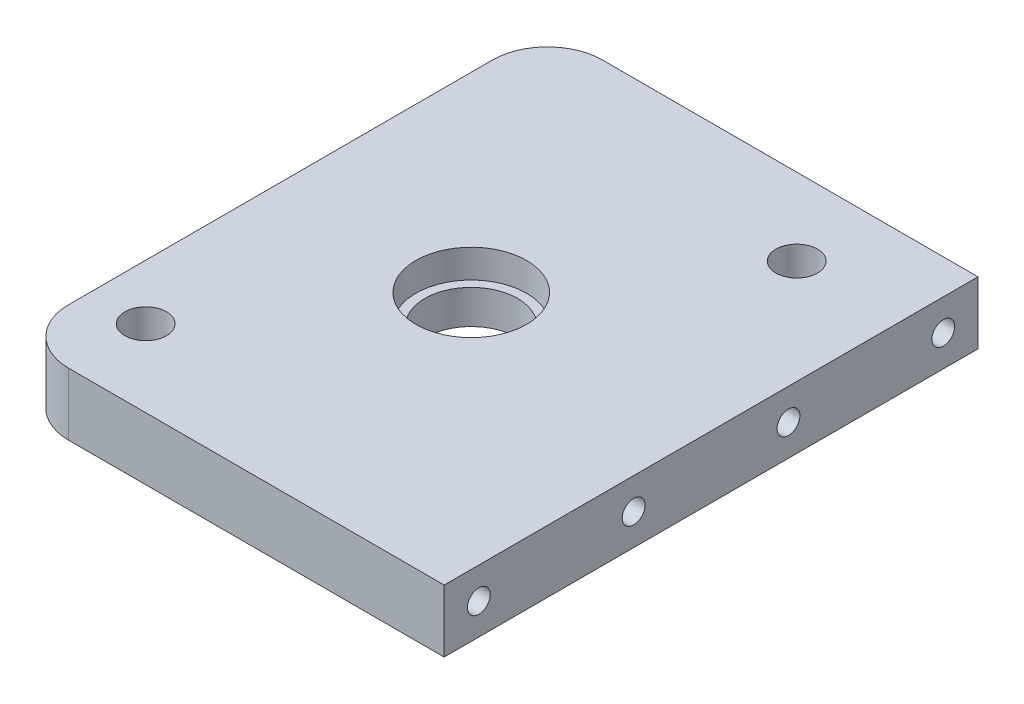
ISO-10303-21;
HEADER;
FILE_DESCRIPTION(('STEP AP214'),'2;1');
FILE_NAME('part.step','',(''),(''),'','','');
FILE_SCHEMA(('AUTOMOTIVE_DESIGN { 1 0 10303 214 1 1 1 1 }'));
ENDSEC;
DATA;
#1=APPLICATION_CONTEXT('core data for automotive mechanical design processes');
#2=APPLICATION_PROTOCOL_DEFINITION('international standard','automotive_design',2000,#1);
#3=PRODUCT_CONTEXT('',#1,'mechanical');
#4=PRODUCT('Part','Part','',(#3));
#5=PRODUCT_RELATED_PRODUCT_CATEGORY('part','',(#4));
#6=PRODUCT_DEFINITION_FORMATION('','',#4);
#7=PRODUCT_DEFINITION_CONTEXT('part definition',#1,'design');
#8=PRODUCT_DEFINITION('design','',#6,#7);
#9=PRODUCT_DEFINITION_SHAPE('','',#8);
#10=(LENGTH_UNIT() NAMED_UNIT(*) SI_UNIT(.MILLI.,.METRE.));
#11=(NAMED_UNIT(*) PLANE_ANGLE_UNIT() SI_UNIT($,.RADIAN.));
#12=(NAMED_UNIT(*) SI_UNIT($,.STERADIAN.) SOLID_ANGLE_UNIT());
#13=UNCERTAINTY_MEASURE_WITH_UNIT(LENGTH_MEASURE(1.E-05),#10,'distance_accuracy_value','');
#14=(GEOMETRIC_REPRESENTATION_CONTEXT(3) GLOBAL_UNCERTAINTY_ASSIGNED_CONTEXT((#13)) GLOBAL_UNIT_ASSIGNED_CONTEXT((#10,
#11,#12)) REPRESENTATION_CONTEXT('',''));
#15=CARTESIAN_POINT('',(0.,0.,0.));
#16=DIRECTION('',(0.,0.,1.));
#17=DIRECTION('',(1.,0.,0.));
#18=AXIS2_PLACEMENT_3D('',#15,#16,#17);
#19=CARTESIAN_POINT('',(18.6,-83.075,0.));
#20=DIRECTION('',(1.,0.,0.));
#21=DIRECTION('',(0.,0.,1.));
#22=AXIS2_PLACEMENT_3D('',#19,#20,#21);
#23=PLANE('',#22);
#24=CARTESIAN_POINT('',(18.6,-214.5,33.5));
#25=DIRECTION('',(1.,0.,0.));
#26=DIRECTION('',(0.,0.,-1.));
#27=AXIS2_PLACEMENT_3D('',#24,#25,#26);
#28=CIRCLE('',#27,1.65);
#29=CARTESIAN_POINT('',(18.6,-214.5,31.85));
#30=VERTEX_POINT('',#29);
#31=EDGE_CURVE('E11',#30,#30,#28,.T.);
#32=ORIENTED_EDGE('',*,*,#31,.T.);
#33=EDGE_LOOP('',(#32));
#34=FACE_BOUND('',#33,.T.);
#35=ADVANCED_FACE('F16',(#34),#23,.T.);
#36=CARTESIAN_POINT('',(18.6,-214.5,33.5));
#37=DIRECTION('',(1.,0.,0.));
#38=DIRECTION('',(0.,0.,-1.));
#39=AXIS2_PLACEMENT_3D('',#36,#37,#38);
#40=CYLINDRICAL_SURFACE('',#39,1.65);
#41=CARTESIAN_POINT('',(34.6,-214.5,33.5));
#42=DIRECTION('',(1.,0.,0.));
#43=DIRECTION('',(0.,0.,-1.));
#44=AXIS2_PLACEMENT_3D('',#41,#42,#43);
#45=CIRCLE('',#44,1.65);
#46=CARTESIAN_POINT('',(34.6,-214.5,31.85));
#47=VERTEX_POINT('',#46);
#48=EDGE_CURVE('E170',#47,#47,#45,.T.);
#49=ORIENTED_EDGE('',*,*,#48,.T.);
#50=EDGE_LOOP('',(#49));
#51=FACE_BOUND('',#50,.T.);
#52=ORIENTED_EDGE('',*,*,#31,.F.);
#53=EDGE_LOOP('',(#52));
#54=FACE_BOUND('',#53,.T.);
#55=ADVANCED_FACE('F266',(#51,#54),#40,.F.);
#56=CARTESIAN_POINT('',(18.6,-83.075,0.));
#57=DIRECTION('',(1.,0.,0.));
#58=DIRECTION('',(0.,0.,1.));
#59=AXIS2_PLACEMENT_3D('',#56,#57,#58);
#60=PLANE('',#59);
#61=CARTESIAN_POINT('',(18.6,-214.5,11.1666666666666));
#62=DIRECTION('',(1.,0.,0.));
#63=DIRECTION('',(0.,0.,-1.));
#64=AXIS2_PLACEMENT_3D('',#61,#62,#63);
#65=CIRCLE('',#64,1.65);
#66=CARTESIAN_POINT('',(18.6,-214.5,9.51666666666664));
#67=VERTEX_POINT('',#66);
#68=EDGE_CURVE('E27',#67,#67,#65,.T.);
#69=ORIENTED_EDGE('',*,*,#68,.T.);
#70=EDGE_LOOP('',(#69));
#71=FACE_BOUND('',#70,.T.);
#72=ADVANCED_FACE('F18',(#71),#60,.T.);
#73=CARTESIAN_POINT('',(18.6,-214.5,11.1666666666666));
#74=DIRECTION('',(1.,0.,0.));
#75=DIRECTION('',(0.,0.,-1.));
#76=AXIS2_PLACEMENT_3D('',#73,#74,#75);
#77=CYLINDRICAL_SURFACE('',#76,1.65);
#78=CARTESIAN_POINT('',(34.6,-214.5,11.1666666666666));
#79=DIRECTION('',(1.,0.,0.));
#80=DIRECTION('',(0.,0.,-1.));
#81=AXIS2_PLACEMENT_3D('',#78,#79,#80);
#82=CIRCLE('',#81,1.65);
#83=CARTESIAN_POINT('',(34.6,-214.5,9.51666666666664));
#84=VERTEX_POINT('',#83);
#85=EDGE_CURVE('E174',#84,#84,#82,.T.);
#86=ORIENTED_EDGE('',*,*,#85,.T.);
#87=EDGE_LOOP('',(#86));
#88=FACE_BOUND('',#87,.T.);
#89=ORIENTED_EDGE('',*,*,#68,.F.);
#90=EDGE_LOOP('',(#89));
#91=FACE_BOUND('',#90,.T.);
#92=ADVANCED_FACE('F338',(#88,#91),#77,.F.);
#93=CARTESIAN_POINT('',(18.6,-83.075,0.));
#94=DIRECTION('',(1.,0.,0.));
#95=DIRECTION('',(0.,0.,1.));
#96=AXIS2_PLACEMENT_3D('',#93,#94,#95);
#97=PLANE('',#96);
#98=CARTESIAN_POINT('',(18.6,-214.5,-11.1666666666666));
#99=DIRECTION('',(-1.,0.,0.));
#100=DIRECTION('',(0.,0.,-1.));
#101=AXIS2_PLACEMENT_3D('',#98,#99,#100);
#102=CIRCLE('',#101,1.65);
#103=CARTESIAN_POINT('',(18.6,-214.5,-12.8166666666666));
#104=VERTEX_POINT('',#103);
#105=EDGE_CURVE('E168',#104,#104,#102,.T.);
#106=ORIENTED_EDGE('',*,*,#105,.F.);
#107=EDGE_LOOP('',(#106));
#108=FACE_BOUND('',#107,.T.);
#109=ADVANCED_FACE('F274',(#108),#97,.T.);
#110=CARTESIAN_POINT('',(18.6,-214.5,-11.1666666666666));
#111=DIRECTION('',(1.,0.,0.));
#112=DIRECTION('',(0.,0.,-1.));
#113=AXIS2_PLACEMENT_3D('',#110,#111,#112);
#114=CYLINDRICAL_SURFACE('',#113,1.65);
#115=CARTESIAN_POINT('',(34.6,-214.5,-11.1666666666666));
#116=DIRECTION('',(-1.,0.,0.));
#117=DIRECTION('',(0.,0.,-1.));
#118=AXIS2_PLACEMENT_3D('',#115,#116,#117);
#119=CIRCLE('',#118,1.65);
#120=CARTESIAN_POINT('',(34.6,-214.5,-12.8166666666666));
#121=VERTEX_POINT('',#120);
#122=EDGE_CURVE('E182',#121,#121,#119,.T.);
#123=ORIENTED_EDGE('',*,*,#122,.F.);
#124=EDGE_LOOP('',(#123));
#125=FACE_BOUND('',#124,.T.);
#126=ORIENTED_EDGE('',*,*,#105,.T.);
#127=EDGE_LOOP('',(#126));
#128=FACE_BOUND('',#127,.T.);
#129=ADVANCED_FACE('F344',(#125,#128),#114,.F.);
#130=CARTESIAN_POINT('',(18.6,-83.075,0.));
#131=DIRECTION('',(1.,0.,0.));
#132=DIRECTION('',(0.,0.,1.));
#133=AXIS2_PLACEMENT_3D('',#130,#131,#132);
#134=PLANE('',#133);
#135=CARTESIAN_POINT('',(18.6,-214.5,-33.5));
#136=DIRECTION('',(-1.,0.,0.));
#137=DIRECTION('',(0.,0.,-1.));
#138=AXIS2_PLACEMENT_3D('',#135,#136,#137);
#139=CIRCLE('',#138,1.65);
#140=CARTESIAN_POINT('',(18.6,-214.5,-35.15));
#141=VERTEX_POINT('',#140);
#142=EDGE_CURVE('E165',#141,#141,#139,.T.);
#143=ORIENTED_EDGE('',*,*,#142,.F.);
#144=EDGE_LOOP('',(#143));
#145=FACE_BOUND('',#144,.T.);
#146=ADVANCED_FACE('F260',(#145),#134,.T.);
#147=CARTESIAN_POINT('',(18.6,-214.5,-33.5));
#148=DIRECTION('',(1.,0.,0.));
#149=DIRECTION('',(0.,0.,-1.));
#150=AXIS2_PLACEMENT_3D('',#147,#148,#149);
#151=CYLINDRICAL_SURFACE('',#150,1.65);
#152=CARTESIAN_POINT('',(34.6,-214.5,-33.5));
#153=DIRECTION('',(-1.,0.,0.));
#154=DIRECTION('',(0.,0.,-1.));
#155=AXIS2_PLACEMENT_3D('',#152,#153,#154);
#156=CIRCLE('',#155,1.65);
#157=CARTESIAN_POINT('',(34.6,-214.5,-35.15));
#158=VERTEX_POINT('',#157);
#159=EDGE_CURVE('E179',#158,#158,#156,.T.);
#160=ORIENTED_EDGE('',*,*,#159,.F.);
#161=EDGE_LOOP('',(#160));
#162=FACE_BOUND('',#161,.T.);
#163=ORIENTED_EDGE('',*,*,#142,.T.);
#164=EDGE_LOOP('',(#163));
#165=FACE_BOUND('',#164,.T.);
#166=ADVANCED_FACE('F255',(#162,#165),#151,.F.);
#167=CARTESIAN_POINT('',(7.05,-214.5,0.));
#168=DIRECTION('',(0.,-1.,0.));
#169=DIRECTION('',(0.,0.,-1.));
#170=AXIS2_PLACEMENT_3D('',#167,#168,#169);
#171=PLANE('',#170);
#172=CARTESIAN_POINT('',(-19.562381937191,-214.5,27.3873347120674));
#173=DIRECTION('',(0.,-1.,0.));
#174=DIRECTION('',(0.,0.,-1.));
#175=AXIS2_PLACEMENT_3D('',#172,#173,#174);
#176=CIRCLE('',#175,3.);
#177=CARTESIAN_POINT('',(-19.562381937191,-214.5,24.3873347120674));
#178=VERTEX_POINT('',#177);
#179=EDGE_CURVE('E169',#178,#178,#176,.T.);
#180=ORIENTED_EDGE('',*,*,#179,.F.);
#181=EDGE_LOOP('',(#180));
#182=FACE_BOUND('',#181,.T.);
#183=ADVANCED_FACE('F250',(#182),#171,.F.);
#184=CARTESIAN_POINT('',(-19.562381937191,-214.5,27.3873347120674));
#185=DIRECTION('',(0.,1.,0.));
#186=DIRECTION('',(0.,0.,1.));
#187=AXIS2_PLACEMENT_3D('',#184,#185,#186);
#188=CYLINDRICAL_SURFACE('',#187,3.);
#189=CARTESIAN_POINT('',(-19.562381937191,-210.,27.3873347120674));
#190=DIRECTION('',(0.,-1.,0.));
#191=DIRECTION('',(0.,0.,-1.));
#192=AXIS2_PLACEMENT_3D('',#189,#190,#191);
#193=CIRCLE('',#192,3.);
#194=CARTESIAN_POINT('',(-19.562381937191,-210.,24.3873347120674));
#195=VERTEX_POINT('',#194);
#196=EDGE_CURVE('E154',#195,#195,#193,.T.);
#197=ORIENTED_EDGE('',*,*,#196,.F.);
#198=EDGE_LOOP('',(#197));
#199=FACE_BOUND('',#198,.T.);
#200=ORIENTED_EDGE('',*,*,#179,.T.);
#201=EDGE_LOOP('',(#200));
#202=FACE_BOUND('',#201,.T.);
#203=ADVANCED_FACE('F246',(#199,#202),#188,.F.);
#204=CARTESIAN_POINT('',(7.05,-214.5,0.));
#205=DIRECTION('',(0.,-1.,0.));
#206=DIRECTION('',(0.,0.,-1.));
#207=AXIS2_PLACEMENT_3D('',#204,#205,#206);
#208=PLANE('',#207);
#209=CARTESIAN_POINT('',(19.562381937191,-214.5,-27.3873347120674));
#210=DIRECTION('',(0.,-1.,0.));
#211=DIRECTION('',(0.,0.,-1.));
#212=AXIS2_PLACEMENT_3D('',#209,#210,#211);
#213=CIRCLE('',#212,3.);
#214=CARTESIAN_POINT('',(19.562381937191,-214.5,-30.3873347120674));
#215=VERTEX_POINT('',#214);
#216=EDGE_CURVE('E151',#215,#215,#213,.T.);
#217=ORIENTED_EDGE('',*,*,#216,.F.);
#218=EDGE_LOOP('',(#217));
#219=FACE_BOUND('',#218,.T.);
#220=ADVANCED_FACE('F249',(#219),#208,.F.);
#221=CARTESIAN_POINT('',(19.562381937191,-214.5,-27.3873347120674));
#222=DIRECTION('',(0.,1.,0.));
#223=DIRECTION('',(0.,0.,1.));
#224=AXIS2_PLACEMENT_3D('',#221,#222,#223);
#225=CYLINDRICAL_SURFACE('',#224,3.);
#226=CARTESIAN_POINT('',(19.562381937191,-210.,-27.3873347120674));
#227=DIRECTION('',(0.,-1.,0.));
#228=DIRECTION('',(0.,0.,-1.));
#229=AXIS2_PLACEMENT_3D('',#226,#227,#228);
#230=CIRCLE('',#229,3.);
#231=CARTESIAN_POINT('',(19.562381937191,-210.,-30.3873347120674));
#232=VERTEX_POINT('',#231);
#233=EDGE_CURVE('E144',#232,#232,#230,.T.);
#234=ORIENTED_EDGE('',*,*,#233,.F.);
#235=EDGE_LOOP('',(#234));
#236=FACE_BOUND('',#235,.T.);
#237=ORIENTED_EDGE('',*,*,#216,.T.);
#238=EDGE_LOOP('',(#237));
#239=FACE_BOUND('',#238,.T.);
#240=ADVANCED_FACE('F364',(#236,#239),#225,.F.);
#241=CARTESIAN_POINT('',(7.05,-214.1,0.));
#242=DIRECTION('',(0.,-1.,0.));
#243=DIRECTION('',(0.,0.,-1.));
#244=AXIS2_PLACEMENT_3D('',#241,#242,#243);
#245=PLANE('',#244);
#246=CARTESIAN_POINT('',(0.,-214.1,0.));
#247=DIRECTION('',(0.,-1.,0.));
#248=DIRECTION('',(0.,0.,-1.));
#249=AXIS2_PLACEMENT_3D('',#246,#247,#248);
#250=CIRCLE('',#249,7.99);
#251=CARTESIAN_POINT('',(0.,-214.1,-7.99));
#252=VERTEX_POINT('',#251);
#253=EDGE_CURVE('E143',#252,#252,#250,.T.);
#254=ORIENTED_EDGE('',*,*,#253,.F.);
#255=EDGE_LOOP('',(#254));
#256=FACE_BOUND('',#255,.T.);
#257=CARTESIAN_POINT('',(0.,-214.1,0.));
#258=DIRECTION('',(0.,-1.,0.));
#259=DIRECTION('',(0.,0.,-1.));
#260=AXIS2_PLACEMENT_3D('',#257,#258,#259);
#261=CIRCLE('',#260,6.696);
#262=CARTESIAN_POINT('',(0.,-214.1,-6.696));
#263=VERTEX_POINT('',#262);
#264=EDGE_CURVE('E177',#263,#263,#261,.T.);
#265=ORIENTED_EDGE('',*,*,#264,.T.);
#266=EDGE_LOOP('',(#265));
#267=FACE_BOUND('',#266,.T.);
#268=ADVANCED_FACE('F278',(#256,#267),#245,.F.);
#269=CARTESIAN_POINT('',(0.,-214.1,0.));
#270=DIRECTION('',(0.,1.,0.));
#271=DIRECTION('',(0.,0.,1.));
#272=AXIS2_PLACEMENT_3D('',#269,#270,#271);
#273=CYLINDRICAL_SURFACE('',#272,7.99);
#274=CARTESIAN_POINT('',(0.,-210.,0.));
#275=DIRECTION('',(0.,-1.,0.));
#276=DIRECTION('',(0.,0.,-1.));
#277=AXIS2_PLACEMENT_3D('',#274,#275,#276);
#278=CIRCLE('',#277,7.99);
#279=CARTESIAN_POINT('',(0.,-210.,-7.99));
#280=VERTEX_POINT('',#279);
#281=EDGE_CURVE('E138',#280,#280,#278,.T.);
#282=ORIENTED_EDGE('',*,*,#281,.F.);
#283=EDGE_LOOP('',(#282));
#284=FACE_BOUND('',#283,.T.);
#285=ORIENTED_EDGE('',*,*,#253,.T.);
#286=EDGE_LOOP('',(#285));
#287=FACE_BOUND('',#286,.T.);
#288=ADVANCED_FACE('F275',(#284,#287),#273,.F.);
#289=CARTESIAN_POINT('',(7.05,-210.,0.));
#290=DIRECTION('',(0.,-1.,0.));
#291=DIRECTION('',(0.,0.,-1.));
#292=AXIS2_PLACEMENT_3D('',#289,#290,#291);
#293=PLANE('',#292);
#294=CARTESIAN_POINT('',(-19.562381937191,-210.,-30.5623819371909));
#295=DIRECTION('',(0.,-1.,0.));
#296=DIRECTION('',(0.,0.,-1.));
#297=AXIS2_PLACEMENT_3D('',#294,#295,#296);
#298=CIRCLE('',#297,7.93761806280911);
#299=CARTESIAN_POINT('',(-27.5,-210.,-30.5623819371909));
#300=VERTEX_POINT('',#299);
#301=CARTESIAN_POINT('',(-19.562381937191,-210.,-38.5));
#302=VERTEX_POINT('',#301);
#303=EDGE_CURVE('E173',#300,#302,#298,.T.);
#304=ORIENTED_EDGE('',*,*,#303,.F.);
#305=DIRECTION('',(0.,0.,-1.));
#306=VECTOR('',#305,1.);
#307=CARTESIAN_POINT('',(-27.5,-210.,0.));
#308=LINE('',#307,#306);
#309=CARTESIAN_POINT('',(-27.5,-210.,30.562381937191));
#310=VERTEX_POINT('',#309);
#311=EDGE_CURVE('E204',#310,#300,#308,.T.);
#312=ORIENTED_EDGE('',*,*,#311,.F.);
#313=CARTESIAN_POINT('',(-19.562381937191,-210.,30.562381937191));
#314=DIRECTION('',(0.,-1.,0.));
#315=DIRECTION('',(0.,0.,-1.));
#316=AXIS2_PLACEMENT_3D('',#313,#314,#315);
#317=CIRCLE('',#316,7.93761806280904);
#318=CARTESIAN_POINT('',(-19.562381937191,-210.,38.5));
#319=VERTEX_POINT('',#318);
#320=EDGE_CURVE('E20',#319,#310,#317,.T.);
#321=ORIENTED_EDGE('',*,*,#320,.F.);
#322=DIRECTION('',(-1.,0.,0.));
#323=VECTOR('',#322,1.);
#324=CARTESIAN_POINT('',(7.51880903140451,-210.,38.5));
#325=LINE('',#324,#323);
#326=CARTESIAN_POINT('',(34.6,-210.,38.5));
#327=VERTEX_POINT('',#326);
#328=EDGE_CURVE('E191',#327,#319,#325,.T.);
#329=ORIENTED_EDGE('',*,*,#328,.F.);
#330=DIRECTION('',(0.,0.,-1.));
#331=VECTOR('',#330,1.);
#332=CARTESIAN_POINT('',(34.6,-210.,0.));
#333=LINE('',#332,#331);
#334=CARTESIAN_POINT('',(34.6,-210.,-38.5));
#335=VERTEX_POINT('',#334);
#336=EDGE_CURVE('E164',#327,#335,#333,.T.);
#337=ORIENTED_EDGE('',*,*,#336,.T.);
#338=DIRECTION('',(1.,0.,0.));
#339=VECTOR('',#338,1.);
#340=CARTESIAN_POINT('',(7.51880903140454,-210.,-38.5));
#341=LINE('',#340,#339);
#342=EDGE_CURVE('E212',#302,#335,#341,.T.);
#343=ORIENTED_EDGE('',*,*,#342,.F.);
#344=EDGE_LOOP('',(#304,#312,#321,#329,#337,#343));
#345=FACE_BOUND('',#344,.T.);
#346=ORIENTED_EDGE('',*,*,#281,.T.);
#347=EDGE_LOOP('',(#346));
#348=FACE_BOUND('',#347,.T.);
#349=ORIENTED_EDGE('',*,*,#233,.T.);
#350=EDGE_LOOP('',(#349));
#351=FACE_BOUND('',#350,.T.);
#352=ORIENTED_EDGE('',*,*,#196,.T.);
#353=EDGE_LOOP('',(#352));
#354=FACE_BOUND('',#353,.T.);
#355=ADVANCED_FACE('F139',(#345,#348,#351,#354),#293,.F.);
#356=CARTESIAN_POINT('',(7.05,-219.,0.));
#357=DIRECTION('',(0.,-1.,0.));
#358=DIRECTION('',(0.,0.,-1.));
#359=AXIS2_PLACEMENT_3D('',#356,#357,#358);
#360=PLANE('',#359);
#361=CARTESIAN_POINT('',(0.,-219.,0.));
#362=DIRECTION('',(0.,-1.,0.));
#363=DIRECTION('',(0.,0.,-1.));
#364=AXIS2_PLACEMENT_3D('',#361,#362,#363);
#365=CIRCLE('',#364,6.696);
#366=CARTESIAN_POINT('',(0.,-219.,-6.696));
#367=VERTEX_POINT('',#366);
#368=EDGE_CURVE('E175',#367,#367,#365,.T.);
#369=ORIENTED_EDGE('',*,*,#368,.F.);
#370=EDGE_LOOP('',(#369));
#371=FACE_BOUND('',#370,.T.);
#372=CARTESIAN_POINT('',(-19.562381937191,-219.,-30.5623819371909));
#373=DIRECTION('',(0.,-1.,0.));
#374=DIRECTION('',(0.,0.,-1.));
#375=AXIS2_PLACEMENT_3D('',#372,#373,#374);
#376=CIRCLE('',#375,7.93761806280911);
#377=CARTESIAN_POINT('',(-27.5,-219.,-30.5623819371909));
#378=VERTEX_POINT('',#377);
#379=CARTESIAN_POINT('',(-19.562381937191,-219.,-38.5));
#380=VERTEX_POINT('',#379);
#381=EDGE_CURVE('E213',#378,#380,#376,.T.);
#382=ORIENTED_EDGE('',*,*,#381,.T.);
#383=DIRECTION('',(1.,0.,0.));
#384=VECTOR('',#383,1.);
#385=CARTESIAN_POINT('',(7.51880903140454,-219.,-38.5));
#386=LINE('',#385,#384);
#387=CARTESIAN_POINT('',(34.6,-219.,-38.5));
#388=VERTEX_POINT('',#387);
#389=EDGE_CURVE('E196',#380,#388,#386,.T.);
#390=ORIENTED_EDGE('',*,*,#389,.T.);
#391=DIRECTION('',(0.,0.,-1.));
#392=VECTOR('',#391,1.);
#393=CARTESIAN_POINT('',(34.6,-219.,0.));
#394=LINE('',#393,#392);
#395=CARTESIAN_POINT('',(34.6,-219.,38.5));
#396=VERTEX_POINT('',#395);
#397=EDGE_CURVE('E163',#396,#388,#394,.T.);
#398=ORIENTED_EDGE('',*,*,#397,.F.);
#399=DIRECTION('',(-1.,0.,0.));
#400=VECTOR('',#399,1.);
#401=CARTESIAN_POINT('',(7.51880903140451,-219.,38.5));
#402=LINE('',#401,#400);
#403=CARTESIAN_POINT('',(-19.562381937191,-219.,38.5));
#404=VERTEX_POINT('',#403);
#405=EDGE_CURVE('E197',#396,#404,#402,.T.);
#406=ORIENTED_EDGE('',*,*,#405,.T.);
#407=CARTESIAN_POINT('',(-19.562381937191,-219.,30.562381937191));
#408=DIRECTION('',(0.,-1.,0.));
#409=DIRECTION('',(0.,0.,-1.));
#410=AXIS2_PLACEMENT_3D('',#407,#408,#409);
#411=CIRCLE('',#410,7.93761806280904);
#412=CARTESIAN_POINT('',(-27.5,-219.,30.562381937191));
#413=VERTEX_POINT('',#412);
#414=EDGE_CURVE('E232',#404,#413,#411,.T.);
#415=ORIENTED_EDGE('',*,*,#414,.T.);
#416=DIRECTION('',(0.,0.,-1.));
#417=VECTOR('',#416,1.);
#418=CARTESIAN_POINT('',(-27.5,-219.,0.));
#419=LINE('',#418,#417);
#420=EDGE_CURVE('E190',#413,#378,#419,.T.);
#421=ORIENTED_EDGE('',*,*,#420,.T.);
#422=EDGE_LOOP('',(#382,#390,#398,#406,#415,#421));
#423=FACE_BOUND('',#422,.T.);
#424=ADVANCED_FACE('F347',(#371,#423),#360,.T.);
#425=CARTESIAN_POINT('',(0.,-219.,0.));
#426=DIRECTION('',(0.,1.,0.));
#427=DIRECTION('',(0.,0.,1.));
#428=AXIS2_PLACEMENT_3D('',#425,#426,#427);
#429=CYLINDRICAL_SURFACE('',#428,6.696);
#430=ORIENTED_EDGE('',*,*,#368,.T.);
#431=EDGE_LOOP('',(#430));
#432=FACE_BOUND('',#431,.T.);
#433=ORIENTED_EDGE('',*,*,#264,.F.);
#434=EDGE_LOOP('',(#433));
#435=FACE_BOUND('',#434,.T.);
#436=ADVANCED_FACE('F350',(#432,#435),#429,.F.);
#437=CARTESIAN_POINT('',(-27.5,-219.,0.));
#438=DIRECTION('',(1.,0.,0.));
#439=DIRECTION('',(0.,0.,1.));
#440=AXIS2_PLACEMENT_3D('',#437,#438,#439);
#441=PLANE('',#440);
#442=ORIENTED_EDGE('',*,*,#311,.T.);
#443=DIRECTION('',(0.,1.,0.));
#444=VECTOR('',#443,1.);
#445=CARTESIAN_POINT('',(-27.5,-219.,-30.5623819371909));
#446=LINE('',#445,#444);
#447=EDGE_CURVE('E209',#378,#300,#446,.T.);
#448=ORIENTED_EDGE('',*,*,#447,.F.);
#449=ORIENTED_EDGE('',*,*,#420,.F.);
#450=DIRECTION('',(0.,1.,0.));
#451=VECTOR('',#450,1.);
#452=CARTESIAN_POINT('',(-27.5,-219.,30.562381937191));
#453=LINE('',#452,#451);
#454=EDGE_CURVE('E236',#413,#310,#453,.T.);
#455=ORIENTED_EDGE('',*,*,#454,.T.);
#456=EDGE_LOOP('',(#442,#448,#449,#455));
#457=FACE_BOUND('',#456,.T.);
#458=ADVANCED_FACE('F295',(#457),#441,.F.);
#459=CARTESIAN_POINT('',(-19.562381937191,-219.,30.562381937191));
#460=DIRECTION('',(0.,1.,0.));
#461=DIRECTION('',(0.,0.,1.));
#462=AXIS2_PLACEMENT_3D('',#459,#460,#461);
#463=CYLINDRICAL_SURFACE('',#462,7.93761806280904);
#464=ORIENTED_EDGE('',*,*,#320,.T.);
#465=ORIENTED_EDGE('',*,*,#454,.F.);
#466=ORIENTED_EDGE('',*,*,#414,.F.);
#467=DIRECTION('',(0.,1.,0.));
#468=VECTOR('',#467,1.);
#469=CARTESIAN_POINT('',(-19.562381937191,-219.,38.5));
#470=LINE('',#469,#468);
#471=EDGE_CURVE('E195',#404,#319,#470,.T.);
#472=ORIENTED_EDGE('',*,*,#471,.T.);
#473=EDGE_LOOP('',(#464,#465,#466,#472));
#474=FACE_BOUND('',#473,.T.);
#475=ADVANCED_FACE('F288',(#474),#463,.T.);
#476=CARTESIAN_POINT('',(7.51880903140451,-219.,38.5));
#477=DIRECTION('',(0.,0.,-1.));
#478=DIRECTION('',(0.,-1.,0.));
#479=AXIS2_PLACEMENT_3D('',#476,#477,#478);
#480=PLANE('',#479);
#481=ORIENTED_EDGE('',*,*,#328,.T.);
#482=ORIENTED_EDGE('',*,*,#471,.F.);
#483=ORIENTED_EDGE('',*,*,#405,.F.);
#484=DIRECTION('',(0.,1.,0.));
#485=VECTOR('',#484,1.);
#486=CARTESIAN_POINT('',(34.6,-219.,38.5));
#487=LINE('',#486,#485);
#488=EDGE_CURVE('E159',#396,#327,#487,.T.);
#489=ORIENTED_EDGE('',*,*,#488,.T.);
#490=EDGE_LOOP('',(#481,#482,#483,#489));
#491=FACE_BOUND('',#490,.T.);
#492=ADVANCED_FACE('F286',(#491),#480,.F.);
#493=CARTESIAN_POINT('',(7.51880903140454,-219.,-38.5));
#494=DIRECTION('',(0.,0.,1.));
#495=DIRECTION('',(1.,0.,0.));
#496=AXIS2_PLACEMENT_3D('',#493,#494,#495);
#497=PLANE('',#496);
#498=ORIENTED_EDGE('',*,*,#342,.T.);
#499=DIRECTION('',(0.,1.,0.));
#500=VECTOR('',#499,1.);
#501=CARTESIAN_POINT('',(34.6,-219.,-38.5));
#502=LINE('',#501,#500);
#503=EDGE_CURVE('E208',#388,#335,#502,.T.);
#504=ORIENTED_EDGE('',*,*,#503,.F.);
#505=ORIENTED_EDGE('',*,*,#389,.F.);
#506=DIRECTION('',(0.,1.,0.));
#507=VECTOR('',#506,1.);
#508=CARTESIAN_POINT('',(-19.562381937191,-219.,-38.5));
#509=LINE('',#508,#507);
#510=EDGE_CURVE('E187',#380,#302,#509,.T.);
#511=ORIENTED_EDGE('',*,*,#510,.T.);
#512=EDGE_LOOP('',(#498,#504,#505,#511));
#513=FACE_BOUND('',#512,.T.);
#514=ADVANCED_FACE('F285',(#513),#497,.F.);
#515=CARTESIAN_POINT('',(-19.562381937191,-219.,-30.5623819371909));
#516=DIRECTION('',(0.,1.,0.));
#517=DIRECTION('',(0.,0.,1.));
#518=AXIS2_PLACEMENT_3D('',#515,#516,#517);
#519=CYLINDRICAL_SURFACE('',#518,7.93761806280911);
#520=ORIENTED_EDGE('',*,*,#303,.T.);
#521=ORIENTED_EDGE('',*,*,#510,.F.);
#522=ORIENTED_EDGE('',*,*,#381,.F.);
#523=ORIENTED_EDGE('',*,*,#447,.T.);
#524=EDGE_LOOP('',(#520,#521,#522,#523));
#525=FACE_BOUND('',#524,.T.);
#526=ADVANCED_FACE('F281',(#525),#519,.T.);
#527=CARTESIAN_POINT('',(34.6,-219.,0.));
#528=DIRECTION('',(1.,0.,0.));
#529=DIRECTION('',(0.,0.,1.));
#530=AXIS2_PLACEMENT_3D('',#527,#528,#529);
#531=PLANE('',#530);
#532=ORIENTED_EDGE('',*,*,#48,.F.);
#533=EDGE_LOOP('',(#532));
#534=FACE_BOUND('',#533,.T.);
#535=ORIENTED_EDGE('',*,*,#85,.F.);
#536=EDGE_LOOP('',(#535));
#537=FACE_BOUND('',#536,.T.);
#538=ORIENTED_EDGE('',*,*,#336,.F.);
#539=ORIENTED_EDGE('',*,*,#488,.F.);
#540=ORIENTED_EDGE('',*,*,#397,.T.);
#541=ORIENTED_EDGE('',*,*,#503,.T.);
#542=EDGE_LOOP('',(#538,#539,#540,#541));
#543=FACE_BOUND('',#542,.T.);
#544=ORIENTED_EDGE('',*,*,#159,.T.);
#545=EDGE_LOOP('',(#544));
#546=FACE_BOUND('',#545,.T.);
#547=ORIENTED_EDGE('',*,*,#122,.T.);
#548=EDGE_LOOP('',(#547));
#549=FACE_BOUND('',#548,.T.);
#550=ADVANCED_FACE('F279',(#534,#537,#543,#546,#549),#531,.T.);
#551=CLOSED_SHELL('',(#35,#55,#72,#92,#109,#129,#146,#166,#183,#203,#220,#240,#268,#288,#355,
#424,#436,#458,#475,#492,#514,#526,#550));
#552=MANIFOLD_SOLID_BREP('B1',#551);
#553=ADVANCED_BREP_SHAPE_REPRESENTATION('',(#18,#552),#14);
#554=SHAPE_DEFINITION_REPRESENTATION(#9,#553);
ENDSEC;
END-ISO-10303-21;
